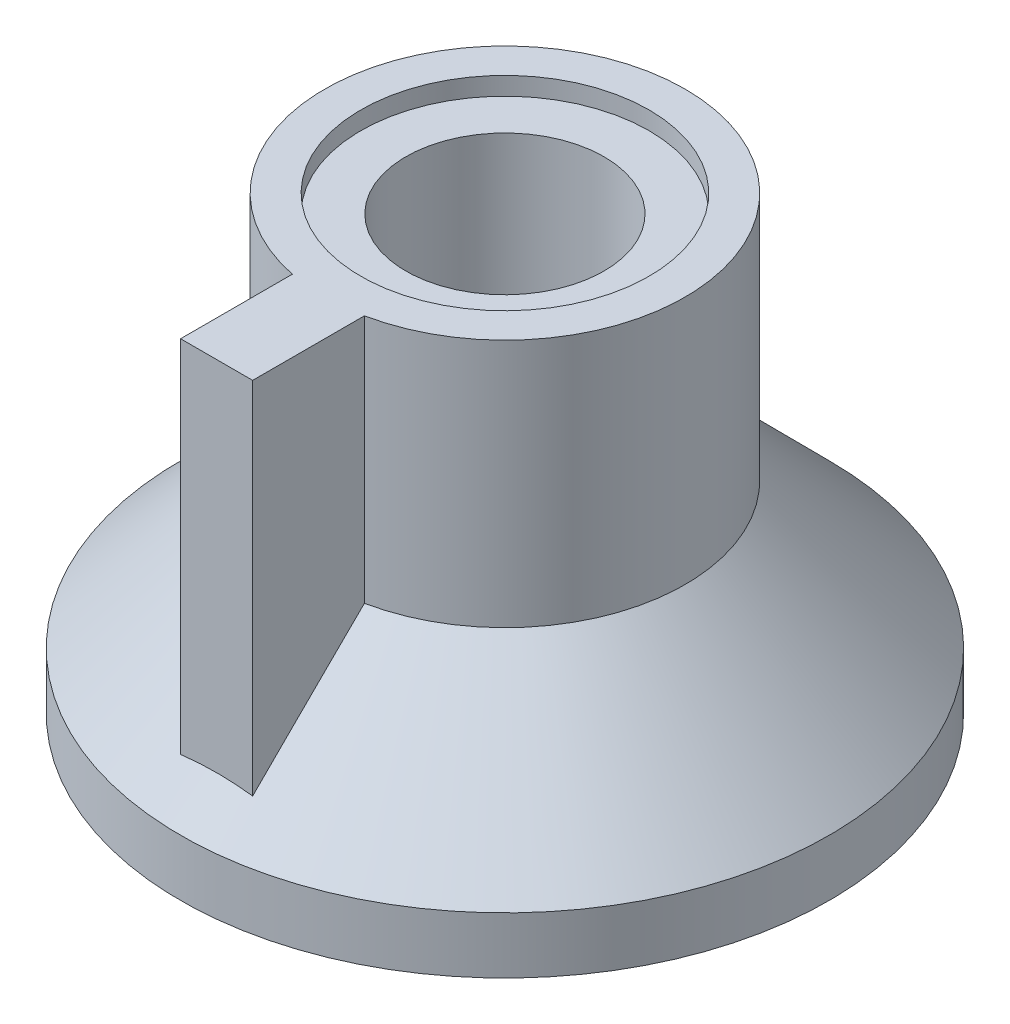
ISO-10303-21;
HEADER;
FILE_DESCRIPTION(('STEP AP214'),'2;1');
FILE_NAME('part.step','',(''),(''),'','','');
FILE_SCHEMA(('AUTOMOTIVE_DESIGN { 1 0 10303 214 1 1 1 1 }'));
ENDSEC;
DATA;
#1=APPLICATION_CONTEXT('core data for automotive mechanical design processes');
#2=APPLICATION_PROTOCOL_DEFINITION('international standard','automotive_design',2000,#1);
#3=PRODUCT_CONTEXT('',#1,'mechanical');
#4=PRODUCT('Part','Part','',(#3));
#5=PRODUCT_RELATED_PRODUCT_CATEGORY('part','',(#4));
#6=PRODUCT_DEFINITION_FORMATION('','',#4);
#7=PRODUCT_DEFINITION_CONTEXT('part definition',#1,'design');
#8=PRODUCT_DEFINITION('design','',#6,#7);
#9=PRODUCT_DEFINITION_SHAPE('','',#8);
#10=(LENGTH_UNIT() NAMED_UNIT(*) SI_UNIT(.MILLI.,.METRE.));
#11=(NAMED_UNIT(*) PLANE_ANGLE_UNIT() SI_UNIT($,.RADIAN.));
#12=(NAMED_UNIT(*) SI_UNIT($,.STERADIAN.) SOLID_ANGLE_UNIT());
#13=UNCERTAINTY_MEASURE_WITH_UNIT(LENGTH_MEASURE(1.E-05),#10,'distance_accuracy_value','');
#14=(GEOMETRIC_REPRESENTATION_CONTEXT(3) GLOBAL_UNCERTAINTY_ASSIGNED_CONTEXT((#13)) GLOBAL_UNIT_ASSIGNED_CONTEXT((#10,
#11,#12)) REPRESENTATION_CONTEXT('',''));
#15=CARTESIAN_POINT('',(0.,0.,0.));
#16=DIRECTION('',(0.,0.,1.));
#17=DIRECTION('',(1.,0.,0.));
#18=AXIS2_PLACEMENT_3D('',#15,#16,#17);
#19=CARTESIAN_POINT('',(0.,14.0884146341469,2.75));
#20=DIRECTION('',(0.,-1.,0.));
#21=DIRECTION('',(0.,0.,-1.));
#22=AXIS2_PLACEMENT_3D('',#19,#20,#21);
#23=PLANE('',#22);
#24=CARTESIAN_POINT('',(0.,14.0884146341469,0.));
#25=DIRECTION('',(0.,-1.,0.));
#26=DIRECTION('',(0.,0.,-1.));
#27=AXIS2_PLACEMENT_3D('',#24,#25,#26);
#28=CIRCLE('',#27,4.);
#29=CARTESIAN_POINT('',(0.,14.0884146341469,-4.));
#30=VERTEX_POINT('',#29);
#31=EDGE_CURVE('E146',#30,#30,#28,.T.);
#32=ORIENTED_EDGE('',*,*,#31,.F.);
#33=EDGE_LOOP('',(#32));
#34=FACE_BOUND('',#33,.T.);
#35=CARTESIAN_POINT('',(0.,14.0884146341469,0.));
#36=DIRECTION('',(0.,-1.,0.));
#37=DIRECTION('',(0.,0.,-1.));
#38=AXIS2_PLACEMENT_3D('',#35,#36,#37);
#39=CIRCLE('',#38,2.75);
#40=CARTESIAN_POINT('',(0.,14.0884146341469,-2.75));
#41=VERTEX_POINT('',#40);
#42=EDGE_CURVE('E48',#41,#41,#39,.T.);
#43=ORIENTED_EDGE('',*,*,#42,.T.);
#44=EDGE_LOOP('',(#43));
#45=FACE_BOUND('',#44,.T.);
#46=ADVANCED_FACE('F39',(#34,#45),#23,.F.);
#47=CARTESIAN_POINT('',(0.,0.,0.));
#48=DIRECTION('',(0.,-1.,0.));
#49=DIRECTION('',(0.,0.,-1.));
#50=AXIS2_PLACEMENT_3D('',#47,#48,#49);
#51=CYLINDRICAL_SURFACE('',#50,2.75);
#52=ORIENTED_EDGE('',*,*,#42,.F.);
#53=EDGE_LOOP('',(#52));
#54=FACE_BOUND('',#53,.T.);
#55=CARTESIAN_POINT('',(0.,4.50914634146342,0.));
#56=DIRECTION('',(0.,-1.,0.));
#57=DIRECTION('',(0.,0.,-1.));
#58=AXIS2_PLACEMENT_3D('',#55,#56,#57);
#59=CIRCLE('',#58,2.75);
#60=CARTESIAN_POINT('',(0.,4.50914634146342,-2.75));
#61=VERTEX_POINT('',#60);
#62=EDGE_CURVE('E168',#61,#61,#59,.T.);
#63=ORIENTED_EDGE('',*,*,#62,.T.);
#64=EDGE_LOOP('',(#63));
#65=FACE_BOUND('',#64,.T.);
#66=ADVANCED_FACE('F181',(#54,#65),#51,.F.);
#67=CARTESIAN_POINT('',(0.,4.5091463414634,6.));
#68=DIRECTION('',(0.,1.,0.));
#69=DIRECTION('',(0.,0.,1.));
#70=AXIS2_PLACEMENT_3D('',#67,#68,#69);
#71=PLANE('',#70);
#72=ORIENTED_EDGE('',*,*,#62,.F.);
#73=EDGE_LOOP('',(#72));
#74=FACE_BOUND('',#73,.T.);
#75=CARTESIAN_POINT('',(0.,4.50914634146342,0.));
#76=DIRECTION('',(0.,-1.,0.));
#77=DIRECTION('',(0.,0.,-1.));
#78=AXIS2_PLACEMENT_3D('',#75,#76,#77);
#79=CIRCLE('',#78,6.04081798465623);
#80=CARTESIAN_POINT('',(0.,4.50914634146342,-6.04081798465623));
#81=VERTEX_POINT('',#80);
#82=EDGE_CURVE('E193',#81,#81,#79,.T.);
#83=ORIENTED_EDGE('',*,*,#82,.T.);
#84=EDGE_LOOP('',(#83));
#85=FACE_BOUND('',#84,.T.);
#86=ADVANCED_FACE('F184',(#74,#85),#71,.F.);
#87=CARTESIAN_POINT('',(0.,2.08841463414686,9.));
#88=DIRECTION('',(0.,1.,0.));
#89=DIRECTION('',(0.,0.,1.));
#90=AXIS2_PLACEMENT_3D('',#87,#88,#89);
#91=PLANE('',#90);
#92=CARTESIAN_POINT('',(0.,2.08841463414686,0.));
#93=DIRECTION('',(0.,1.,0.));
#94=DIRECTION('',(0.,0.,1.));
#95=AXIS2_PLACEMENT_3D('',#92,#93,#94);
#96=CIRCLE('',#95,6.04081798465623);
#97=CARTESIAN_POINT('',(0.,2.08841463414686,6.04081798465623));
#98=VERTEX_POINT('',#97);
#99=EDGE_CURVE('E42',#98,#98,#96,.T.);
#100=ORIENTED_EDGE('',*,*,#99,.T.);
#101=EDGE_LOOP('',(#100));
#102=FACE_BOUND('',#101,.T.);
#103=CARTESIAN_POINT('',(0.,2.08841463414686,0.));
#104=DIRECTION('',(0.,-1.,0.));
#105=DIRECTION('',(0.,0.,-1.));
#106=AXIS2_PLACEMENT_3D('',#103,#104,#105);
#107=CIRCLE('',#106,9.);
#108=CARTESIAN_POINT('',(0.,2.08841463414686,-9.));
#109=VERTEX_POINT('',#108);
#110=EDGE_CURVE('E164',#109,#109,#107,.T.);
#111=ORIENTED_EDGE('',*,*,#110,.T.);
#112=EDGE_LOOP('',(#111));
#113=FACE_BOUND('',#112,.T.);
#114=ADVANCED_FACE('F189',(#102,#113),#91,.F.);
#115=CARTESIAN_POINT('',(0.,0.,0.));
#116=DIRECTION('',(0.,-1.,0.));
#117=DIRECTION('',(0.,0.,-1.));
#118=AXIS2_PLACEMENT_3D('',#115,#116,#117);
#119=CYLINDRICAL_SURFACE('',#118,9.);
#120=ORIENTED_EDGE('',*,*,#110,.F.);
#121=EDGE_LOOP('',(#120));
#122=FACE_BOUND('',#121,.T.);
#123=CARTESIAN_POINT('',(0.,3.65548780487854,0.));
#124=DIRECTION('',(0.,-1.,0.));
#125=DIRECTION('',(0.,0.,-1.));
#126=AXIS2_PLACEMENT_3D('',#123,#124,#125);
#127=CIRCLE('',#126,9.);
#128=CARTESIAN_POINT('',(0.,3.65548780487854,-9.));
#129=VERTEX_POINT('',#128);
#130=EDGE_CURVE('E160',#129,#129,#127,.T.);
#131=ORIENTED_EDGE('',*,*,#130,.T.);
#132=EDGE_LOOP('',(#131));
#133=FACE_BOUND('',#132,.T.);
#134=ADVANCED_FACE('F227',(#122,#133),#119,.T.);
#135=CARTESIAN_POINT('',(0.,7.67987804878099,0.));
#136=DIRECTION('',(0.,-1.,0.));
#137=DIRECTION('',(0.,0.,-1.));
#138=AXIS2_PLACEMENT_3D('',#135,#136,#137);
#139=CONICAL_SURFACE('',#138,5.,0.782358659079911);
#140=CARTESIAN_POINT('',(0.,7.67987804878099,0.));
#141=DIRECTION('',(0.,-1.,0.));
#142=DIRECTION('',(0.,0.,-1.));
#143=AXIS2_PLACEMENT_3D('',#140,#141,#142);
#144=CIRCLE('',#143,5.);
#145=CARTESIAN_POINT('',(-1.,7.67987804878099,4.89897948556636));
#146=VERTEX_POINT('',#145);
#147=CARTESIAN_POINT('',(1.,7.67987804878099,4.89897948556636));
#148=VERTEX_POINT('',#147);
#149=EDGE_CURVE('E157',#146,#148,#144,.T.);
#150=ORIENTED_EDGE('',*,*,#149,.T.);
#151=CARTESIAN_POINT('',(1.,11.4018088402573,0.831642315486318));
#152=CARTESIAN_POINT('',(1.,11.3670485444355,0.885573858346167));
#153=CARTESIAN_POINT('',(1.,11.3309880007979,0.938630919926627));
#154=CARTESIAN_POINT('',(1.,11.2568903474023,1.04330738354298));
#155=CARTESIAN_POINT('',(1.,11.2188543520557,1.09492757145025));
#156=CARTESIAN_POINT('',(1.,11.14144335145,1.19703010450978));
#157=CARTESIAN_POINT('',(1.,11.1020702785516,1.24751392990879));
#158=CARTESIAN_POINT('',(1.,11.0222693985447,1.34765235113018));
#159=CARTESIAN_POINT('',(1.,10.9818414229324,1.39730681237136));
#160=CARTESIAN_POINT('',(1.,10.8595183381385,1.54512121965301));
#161=CARTESIAN_POINT('',(1.,10.7764486259682,1.64230691500592));
#162=CARTESIAN_POINT('',(1.,10.6083523714206,1.83503341056042));
#163=CARTESIAN_POINT('',(1.,10.5233249564553,1.93057344274214));
#164=CARTESIAN_POINT('',(1.,10.3525007192907,2.11992674847952));
#165=CARTESIAN_POINT('',(1.,10.2667115435693,2.21374693307329));
#166=CARTESIAN_POINT('',(1.,10.0942471769377,2.40057037480561));
#167=CARTESIAN_POINT('',(1.,10.0075719698485,2.49357361696882));
#168=CARTESIAN_POINT('',(1.,9.74659067964232,2.77170343067731));
#169=CARTESIAN_POINT('',(1.,9.57133766700121,2.95594051773703));
#170=CARTESIAN_POINT('',(1.,9.21941176935777,3.32303005310671));
#171=CARTESIAN_POINT('',(1.,9.04273895441455,3.50588256888302));
#172=CARTESIAN_POINT('',(1.,8.68848914643294,3.87069718623758));
#173=CARTESIAN_POINT('',(1.,8.5109121841479,4.05265931769362));
#174=CARTESIAN_POINT('',(1.,8.15484897219765,4.41629810178652));
#175=CARTESIAN_POINT('',(1.,7.97636168940198,4.59797374164052));
#176=CARTESIAN_POINT('',(1.,7.61895623916045,4.96090355357688));
#177=CARTESIAN_POINT('',(1.,7.44003806806832,5.14215772206695));
#178=CARTESIAN_POINT('',(1.,6.90283541234291,5.6854512728225));
#179=CARTESIAN_POINT('',(1.,6.54408996297313,6.04703475638612));
#180=CARTESIAN_POINT('',(1.,6.05286760696246,6.54118250468659));
#181=CARTESIAN_POINT('',(1.,5.92069375200421,6.6740485173471));
#182=CARTESIAN_POINT('',(1.,5.65626273993722,6.93969894764804));
#183=CARTESIAN_POINT('',(1.,5.52400558242455,7.07248336488655));
#184=CARTESIAN_POINT('',(1.,5.12728707899266,7.47057659965527));
#185=CARTESIAN_POINT('',(1.,4.86272247072895,7.7357824990467));
#186=CARTESIAN_POINT('',(1.,4.01683449731329,8.58309118249149));
#187=CARTESIAN_POINT('',(1.,3.43513472615404,9.16481812948586));
#188=CARTESIAN_POINT('',(1.,2.2712128371213,10.3277503179398));
#189=CARTESIAN_POINT('',(1.,1.68899071863286,10.9089555587835));
#190=CARTESIAN_POINT('',(1.,0.523205548882657,12.0720578946022));
#191=CARTESIAN_POINT('',(1.,-0.0603580674148698,12.653954423193));
#192=CARTESIAN_POINT('',(1.,-1.22770584916326,13.817524210323));
#193=CARTESIAN_POINT('',(1.,-1.81149001423114,14.3991974692463));
#194=CARTESIAN_POINT('',(1.,-2.39533368089207,14.9808109069587));
#195=B_SPLINE_CURVE_WITH_KNOTS('',3,(#151,#152,#153,#154,#155,#156,#157,#158,#159,#160,#161,
#162,#163,#164,#165,#166,#167,#168,#169,#170,#171,#172,#173,#174,#175,#176,#177,#178,#179,#180,
#181,#182,#183,#184,#185,#186,#187,#188,#189,#190,#191,#192,#193,#194),.UNSPECIFIED.,.F.,.F.,(4,
2,2,2,2,2,2,2,2,2,2,2,2,2,2,2,2,2,2,2,2,4),(0.,0.192426070399558,0.384744742286754,
0.576796404389414,0.768878933803585,1.15238113696564,1.53605771696501,1.9174388784254,
2.29882701643588,3.06164217233801,3.82441991601725,4.58717188589532,5.35122188198551,
6.11527836652463,7.64333643754678,8.20557284178515,8.76781199357666,9.89162562118167,
12.3596256470973,14.8276285823227,17.2999453475772,19.7722578392887),.UNSPECIFIED.);
#196=CARTESIAN_POINT('',(1.,4.59894799713915,8.));
#197=VERTEX_POINT('',#196);
#198=EDGE_CURVE('E55',#148,#197,#195,.T.);
#199=ORIENTED_EDGE('',*,*,#198,.T.);
#200=CARTESIAN_POINT('',(-3.52044119969422,3.91673323141253,8.));
#201=CARTESIAN_POINT('',(-3.28076728918034,4.01387262639585,8.));
#202=CARTESIAN_POINT('',(-3.03799244243642,4.10393545729339,8.));
#203=CARTESIAN_POINT('',(-2.5461850871954,4.2669883775391,8.));
#204=CARTESIAN_POINT('',(-2.29713938604931,4.33993843613173,8.));
#205=CARTESIAN_POINT('',(-1.79696576600313,4.46459062996614,8.));
#206=CARTESIAN_POINT('',(-1.54590182004786,4.51654469335717,8.));
#207=CARTESIAN_POINT('',(-1.04030687166521,4.59769260446399,8.));
#208=CARTESIAN_POINT('',(-0.785779622635567,4.62690936168902,8.));
#209=CARTESIAN_POINT('',(-0.332483695941849,4.65709380866691,8.));
#210=CARTESIAN_POINT('',(-0.134030354968585,4.66293214810789,8.));
#211=CARTESIAN_POINT('',(0.262750942756726,4.65971765398824,8.));
#212=CARTESIAN_POINT('',(0.461078906497434,4.65066574036371,8.));
#213=CARTESIAN_POINT('',(0.857310202704768,4.61794907540867,8.));
#214=CARTESIAN_POINT('',(1.05520868687956,4.59422618750933,8.));
#215=CARTESIAN_POINT('',(1.44880421319139,4.53300229011098,8.));
#216=CARTESIAN_POINT('',(1.64450151304014,4.49550291122001,8.));
#217=CARTESIAN_POINT('',(2.16565237394916,4.3780381939184,8.));
#218=CARTESIAN_POINT('',(2.48853073422034,4.2865558126068,8.));
#219=CARTESIAN_POINT('',(3.12502798607132,4.07460455476867,8.));
#220=CARTESIAN_POINT('',(3.43862899405537,3.95408333059022,8.));
#221=CARTESIAN_POINT('',(3.9010957049178,3.75670798085304,8.));
#222=CARTESIAN_POINT('',(4.05365091803292,3.68829393395458,8.));
#223=CARTESIAN_POINT('',(4.35647579124976,3.54653954997369,8.));
#224=CARTESIAN_POINT('',(4.5067452734063,3.47319883173069,8.));
#225=CARTESIAN_POINT('',(4.80446260395829,3.32253396058814,8.));
#226=CARTESIAN_POINT('',(4.95191971346731,3.24522801258186,8.));
#227=CARTESIAN_POINT('',(5.24476156118349,3.08687883471975,8.));
#228=CARTESIAN_POINT('',(5.39014687857564,3.0058366772885,8.));
#229=CARTESIAN_POINT('',(5.53458747880519,2.923169033024,8.));
#230=B_SPLINE_CURVE_WITH_KNOTS('',3,(#200,#201,#202,#203,#204,#205,#206,#207,#208,#209,#210,
#211,#212,#213,#214,#215,#216,#217,#218,#219,#220,#221,#222,#223,#224,#225,#226,#227,#228,#229),
.UNSPECIFIED.,.F.,.F.,(4,2,2,2,2,2,2,2,2,2,2,2,2,2,4),(0.,0.776045988064654,1.5538896182004,
2.32210116342254,3.08953767322001,3.68462046885418,4.27966650100396,4.87708576231592,
5.4744343348758,6.47937250300999,7.48613598509198,7.98764571523449,8.48919429034274,
8.98861666539227,9.48789657033708),.UNSPECIFIED.);
#231=CARTESIAN_POINT('',(-1.00000000000006,4.59894799713928,8.));
#232=VERTEX_POINT('',#231);
#233=EDGE_CURVE('E11',#232,#197,#230,.T.);
#234=ORIENTED_EDGE('',*,*,#233,.F.);
#235=CARTESIAN_POINT('',(-1.,-2.39533368089207,14.9808109069587));
#236=CARTESIAN_POINT('',(-1.,-1.81192343870263,14.3996288517213));
#237=CARTESIAN_POINT('',(-1.,-1.22857231457017,13.8183873577066));
#238=CARTESIAN_POINT('',(-1.,-0.0621337473481297,12.6557248928138));
#239=CARTESIAN_POINT('',(-1.,0.520953711865263,12.074303938111));
#240=CARTESIAN_POINT('',(-1.,1.39528829977401,11.2019823707102));
#241=CARTESIAN_POINT('',(-1.,1.68665695242584,10.9112035703188));
#242=CARTESIAN_POINT('',(-1.,2.26928885317259,10.3295418449156));
#243=CARTESIAN_POINT('',(-1.,2.56055210153006,10.0386589201669));
#244=CARTESIAN_POINT('',(-1.,3.14296383536143,9.45673876586761));
#245=CARTESIAN_POINT('',(-1.,3.43411231172955,9.16570152720283));
#246=CARTESIAN_POINT('',(-1.,4.0162339510135,8.58344645468424));
#247=CARTESIAN_POINT('',(-1.,4.30720711230773,8.29222861920904));
#248=CARTESIAN_POINT('',(-1.,4.88902214324652,7.70944090915042));
#249=CARTESIAN_POINT('',(-1.,5.17986392106586,7.41787094287448));
#250=CARTESIAN_POINT('',(-1.,5.76119644608001,6.83440042485024));
#251=CARTESIAN_POINT('',(-1.,6.05168720455718,6.54249988434469));
#252=CARTESIAN_POINT('',(-1.,6.63210266303382,5.95826912455565));
#253=CARTESIAN_POINT('',(-1.,6.9220274775232,5.66593901910127));
#254=CARTESIAN_POINT('',(-1.,7.35634024802471,5.22684297342539));
#255=CARTESIAN_POINT('',(-1.,7.50102356100139,5.08036921167676));
#256=CARTESIAN_POINT('',(-1.,7.79013563133999,4.78716705628881));
#257=CARTESIAN_POINT('',(-1.,7.93456438556318,4.64043865955351));
#258=CARTESIAN_POINT('',(-1.,8.22320156365376,4.34653277263088));
#259=CARTESIAN_POINT('',(-1.,8.36740971609975,4.19935501579004));
#260=CARTESIAN_POINT('',(-1.,8.65536362017992,3.90455997947766));
#261=CARTESIAN_POINT('',(-1.,8.79910939162152,3.75694271936953));
#262=CARTESIAN_POINT('',(-1.,9.08590186652179,3.46114845874848));
#263=CARTESIAN_POINT('',(-1.,9.22894883393601,3.3129717143043));
#264=CARTESIAN_POINT('',(-1.,9.51413629265114,3.0157015448105));
#265=CARTESIAN_POINT('',(-1.,9.65627663865549,2.86660797999403));
#266=CARTESIAN_POINT('',(-1.,9.86850041862408,2.64182961711056));
#267=CARTESIAN_POINT('',(-1.,9.93912809415583,2.56665888658635));
#268=CARTESIAN_POINT('',(-1.,10.0799103116223,2.41587922378444));
#269=CARTESIAN_POINT('',(-1.,10.1500648671737,2.34027030423564));
#270=CARTESIAN_POINT('',(-1.,10.289726097667,2.18852175027873));
#271=CARTESIAN_POINT('',(-1.,10.3592330632959,2.11238238374746));
#272=CARTESIAN_POINT('',(-1.,10.4974299414441,1.95934877663329));
#273=CARTESIAN_POINT('',(-1.,10.5661197643231,1.88245445489047));
#274=CARTESIAN_POINT('',(-1.,10.7024803533225,1.7275120151824));
#275=CARTESIAN_POINT('',(-1.,10.7701489919713,1.64946202100381));
#276=CARTESIAN_POINT('',(-1.,10.9038159092524,1.4919733809077));
#277=CARTESIAN_POINT('',(-1.,10.9698146834464,1.41253515908924));
#278=CARTESIAN_POINT('',(-1.,11.0669709677408,1.29177720282138));
#279=CARTESIAN_POINT('',(-1.,11.0990767940631,1.25122146672919));
#280=CARTESIAN_POINT('',(-1.,11.1624740322686,1.16948413201165));
#281=CARTESIAN_POINT('',(-1.,11.1937655337223,1.12830260301543));
#282=CARTESIAN_POINT('',(-1.,11.2553484862779,1.04512775972601));
#283=CARTESIAN_POINT('',(-1.,11.2856388836668,1.00313365950058));
#284=CARTESIAN_POINT('',(-1.,11.3448458587339,0.918166591563173));
#285=CARTESIAN_POINT('',(-1.,11.3737619051945,0.875193254697516));
#286=CARTESIAN_POINT('',(-1.,11.4018088402573,0.831642315486318));
#287=B_SPLINE_CURVE_WITH_KNOTS('',3,(#235,#236,#237,#238,#239,#240,#241,#242,#243,#244,#245,
#246,#247,#248,#249,#250,#251,#252,#253,#254,#255,#256,#257,#258,#259,#260,#261,#262,#263,#264,
#265,#266,#267,#268,#269,#270,#271,#272,#273,#274,#275,#276,#277,#278,#279,#280,#281,#282,#283,
#284,#285,#286),.UNSPECIFIED.,.F.,.F.,(4,2,2,2,2,2,2,2,2,2,2,2,2,2,2,2,2,2,2,2,2,2,2,2,2,4),(0.,
2.47047795792982,4.9407757956355,6.17569764355411,7.41061639408295,8.64561875969583,
9.88063237839821,11.1161150143839,12.3515568232814,13.5867154416645,14.2043643178835,
14.8220207572017,15.4401750399186,16.058302479841,16.676174889744,17.2941439508912,
17.6035777141728,17.9130025333648,18.2222810291352,18.5315931454717,18.8414792197935,
19.1512722248861,19.3064414473141,19.4615935293755,19.6169040278414,19.7722740770811),.UNSPECIFIED.);
#288=EDGE_CURVE('E113',#232,#146,#287,.T.);
#289=ORIENTED_EDGE('',*,*,#288,.T.);
#290=EDGE_LOOP('',(#150,#199,#234,#289));
#291=FACE_BOUND('',#290,.T.);
#292=ORIENTED_EDGE('',*,*,#130,.F.);
#293=EDGE_LOOP('',(#292));
#294=FACE_BOUND('',#293,.T.);
#295=ADVANCED_FACE('F123',(#291,#294),#139,.T.);
#296=CARTESIAN_POINT('',(0.,0.,0.));
#297=DIRECTION('',(0.,-1.,0.));
#298=DIRECTION('',(0.,0.,-1.));
#299=AXIS2_PLACEMENT_3D('',#296,#297,#298);
#300=CYLINDRICAL_SURFACE('',#299,5.);
#301=CARTESIAN_POINT('',(0.,14.5884146341469,0.));
#302=DIRECTION('',(0.,-1.,0.));
#303=DIRECTION('',(0.,0.,-1.));
#304=AXIS2_PLACEMENT_3D('',#301,#302,#303);
#305=CIRCLE('',#304,5.);
#306=CARTESIAN_POINT('',(-1.,14.5884146341469,4.89897948556636));
#307=VERTEX_POINT('',#306);
#308=CARTESIAN_POINT('',(1.,14.5884146341469,4.89897948556636));
#309=VERTEX_POINT('',#308);
#310=EDGE_CURVE('E154',#307,#309,#305,.T.);
#311=ORIENTED_EDGE('',*,*,#310,.T.);
#312=DIRECTION('',(0.,-1.,0.));
#313=VECTOR('',#312,1.);
#314=CARTESIAN_POINT('',(1.,0.,4.89897948556635));
#315=LINE('',#314,#313);
#316=EDGE_CURVE('E83',#309,#148,#315,.T.);
#317=ORIENTED_EDGE('',*,*,#316,.T.);
#318=ORIENTED_EDGE('',*,*,#149,.F.);
#319=DIRECTION('',(0.,-1.,0.));
#320=VECTOR('',#319,1.);
#321=CARTESIAN_POINT('',(-0.999999999999999,0.,4.89897948556635));
#322=LINE('',#321,#320);
#323=EDGE_CURVE('E108',#146,#307,#322,.F.);
#324=ORIENTED_EDGE('',*,*,#323,.T.);
#325=EDGE_LOOP('',(#311,#317,#318,#324));
#326=FACE_BOUND('',#325,.T.);
#327=ADVANCED_FACE('F218',(#326),#300,.T.);
#328=CARTESIAN_POINT('',(0.,14.5884146341469,4.));
#329=DIRECTION('',(0.,-1.,0.));
#330=DIRECTION('',(0.,0.,-1.));
#331=AXIS2_PLACEMENT_3D('',#328,#329,#330);
#332=PLANE('',#331);
#333=ORIENTED_EDGE('',*,*,#310,.F.);
#334=DIRECTION('',(0.,0.,1.));
#335=VECTOR('',#334,1.);
#336=CARTESIAN_POINT('',(-1.,14.5884146341469,4.5));
#337=LINE('',#336,#335);
#338=CARTESIAN_POINT('',(-1.,14.5884146341469,8.));
#339=VERTEX_POINT('',#338);
#340=EDGE_CURVE('E87',#307,#339,#337,.T.);
#341=ORIENTED_EDGE('',*,*,#340,.T.);
#342=DIRECTION('',(-1.,0.,0.));
#343=VECTOR('',#342,1.);
#344=CARTESIAN_POINT('',(-1.,14.5884146341469,8.));
#345=LINE('',#344,#343);
#346=CARTESIAN_POINT('',(1.,14.5884146341469,8.));
#347=VERTEX_POINT('',#346);
#348=EDGE_CURVE('E94',#347,#339,#345,.T.);
#349=ORIENTED_EDGE('',*,*,#348,.F.);
#350=DIRECTION('',(0.,0.,1.));
#351=VECTOR('',#350,1.);
#352=CARTESIAN_POINT('',(1.,14.5884146341469,4.5));
#353=LINE('',#352,#351);
#354=EDGE_CURVE('E79',#309,#347,#353,.T.);
#355=ORIENTED_EDGE('',*,*,#354,.F.);
#356=EDGE_LOOP('',(#333,#341,#349,#355));
#357=FACE_BOUND('',#356,.T.);
#358=CARTESIAN_POINT('',(0.,14.5884146341469,0.));
#359=DIRECTION('',(0.,-1.,0.));
#360=DIRECTION('',(0.,0.,-1.));
#361=AXIS2_PLACEMENT_3D('',#358,#359,#360);
#362=CIRCLE('',#361,4.);
#363=CARTESIAN_POINT('',(0.,14.5884146341469,-4.));
#364=VERTEX_POINT('',#363);
#365=EDGE_CURVE('E150',#364,#364,#362,.T.);
#366=ORIENTED_EDGE('',*,*,#365,.T.);
#367=EDGE_LOOP('',(#366));
#368=FACE_BOUND('',#367,.T.);
#369=ADVANCED_FACE('F97',(#357,#368),#332,.F.);
#370=CARTESIAN_POINT('',(0.,0.,0.));
#371=DIRECTION('',(0.,-1.,0.));
#372=DIRECTION('',(0.,0.,-1.));
#373=AXIS2_PLACEMENT_3D('',#370,#371,#372);
#374=CYLINDRICAL_SURFACE('',#373,4.);
#375=ORIENTED_EDGE('',*,*,#365,.F.);
#376=EDGE_LOOP('',(#375));
#377=FACE_BOUND('',#376,.T.);
#378=ORIENTED_EDGE('',*,*,#31,.T.);
#379=EDGE_LOOP('',(#378));
#380=FACE_BOUND('',#379,.T.);
#381=ADVANCED_FACE('F132',(#377,#380),#374,.F.);
#382=CARTESIAN_POINT('',(-1.,2.08841463414686,4.5));
#383=DIRECTION('',(-1.,0.,0.));
#384=DIRECTION('',(0.,-1.,0.));
#385=AXIS2_PLACEMENT_3D('',#382,#383,#384);
#386=PLANE('',#385);
#387=ORIENTED_EDGE('',*,*,#288,.F.);
#388=DIRECTION('',(0.,-1.,0.));
#389=VECTOR('',#388,1.);
#390=CARTESIAN_POINT('',(-1.,2.08841463414686,8.));
#391=LINE('',#390,#389);
#392=EDGE_CURVE('E88',#339,#232,#391,.T.);
#393=ORIENTED_EDGE('',*,*,#392,.F.);
#394=ORIENTED_EDGE('',*,*,#340,.F.);
#395=ORIENTED_EDGE('',*,*,#323,.F.);
#396=EDGE_LOOP('',(#387,#393,#394,#395));
#397=FACE_BOUND('',#396,.T.);
#398=ADVANCED_FACE('F127',(#397),#386,.T.);
#399=CARTESIAN_POINT('',(1.,2.08841463414686,4.5));
#400=DIRECTION('',(1.,0.,0.));
#401=DIRECTION('',(0.,1.,0.));
#402=AXIS2_PLACEMENT_3D('',#399,#400,#401);
#403=PLANE('',#402);
#404=ORIENTED_EDGE('',*,*,#198,.F.);
#405=ORIENTED_EDGE('',*,*,#316,.F.);
#406=ORIENTED_EDGE('',*,*,#354,.T.);
#407=DIRECTION('',(0.,1.,0.));
#408=VECTOR('',#407,1.);
#409=CARTESIAN_POINT('',(1.,2.08841463414686,8.));
#410=LINE('',#409,#408);
#411=EDGE_CURVE('E82',#197,#347,#410,.T.);
#412=ORIENTED_EDGE('',*,*,#411,.F.);
#413=EDGE_LOOP('',(#404,#405,#406,#412));
#414=FACE_BOUND('',#413,.T.);
#415=ADVANCED_FACE('F81',(#414),#403,.T.);
#416=CARTESIAN_POINT('',(0.,0.,8.));
#417=DIRECTION('',(0.,0.,-1.));
#418=DIRECTION('',(-1.,0.,0.));
#419=AXIS2_PLACEMENT_3D('',#416,#417,#418);
#420=PLANE('',#419);
#421=ORIENTED_EDGE('',*,*,#392,.T.);
#422=ORIENTED_EDGE('',*,*,#233,.T.);
#423=ORIENTED_EDGE('',*,*,#411,.T.);
#424=ORIENTED_EDGE('',*,*,#348,.T.);
#425=EDGE_LOOP('',(#421,#422,#423,#424));
#426=FACE_BOUND('',#425,.T.);
#427=ADVANCED_FACE('F93',(#426),#420,.F.);
#428=CARTESIAN_POINT('',(0.,1.19524201123733,0.));
#429=DIRECTION('',(0.,-1.,0.));
#430=DIRECTION('',(0.,0.,-1.));
#431=AXIS2_PLACEMENT_3D('',#428,#429,#430);
#432=CYLINDRICAL_SURFACE('',#431,6.04081798465623);
#433=ORIENTED_EDGE('',*,*,#82,.F.);
#434=EDGE_LOOP('',(#433));
#435=FACE_BOUND('',#434,.T.);
#436=ORIENTED_EDGE('',*,*,#99,.F.);
#437=EDGE_LOOP('',(#436));
#438=FACE_BOUND('',#437,.T.);
#439=ADVANCED_FACE('F202',(#435,#438),#432,.F.);
#440=CLOSED_SHELL('',(#46,#66,#86,#114,#134,#295,#327,#369,#381,#398,#415,#427,#439));
#441=MANIFOLD_SOLID_BREP('B2',#440);
#442=ADVANCED_BREP_SHAPE_REPRESENTATION('',(#18,#441),#14);
#443=SHAPE_DEFINITION_REPRESENTATION(#9,#442);
ENDSEC;
END-ISO-10303-21;
